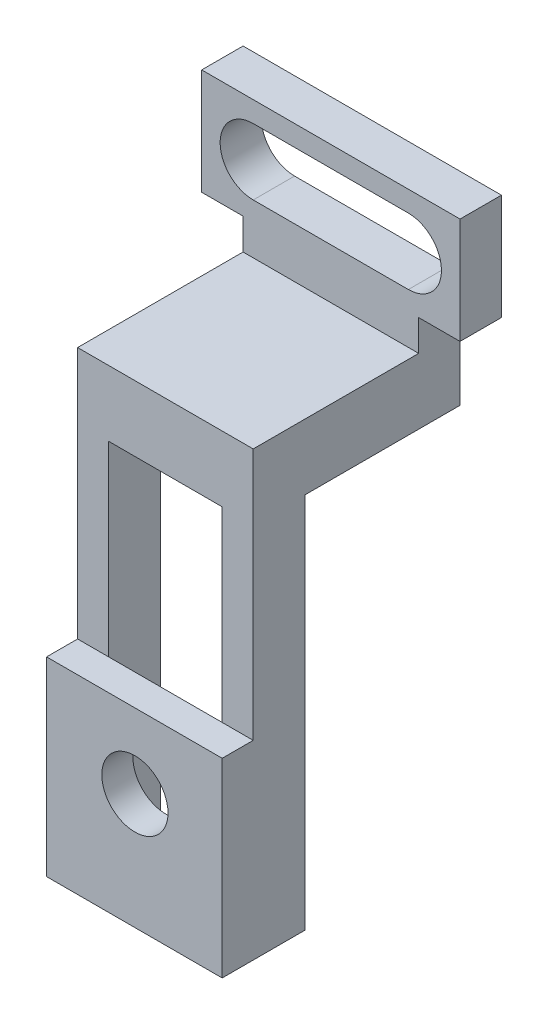
ISO-10303-21;
HEADER;
FILE_DESCRIPTION(('STEP AP214'),'2;1');
FILE_NAME('part.step','',(''),(''),'','','');
FILE_SCHEMA(('AUTOMOTIVE_DESIGN { 1 0 10303 214 1 1 1 1 }'));
ENDSEC;
DATA;
#1=APPLICATION_CONTEXT('core data for automotive mechanical design processes');
#2=APPLICATION_PROTOCOL_DEFINITION('international standard','automotive_design',2000,#1);
#3=PRODUCT_CONTEXT('',#1,'mechanical');
#4=PRODUCT('Part','Part','',(#3));
#5=PRODUCT_RELATED_PRODUCT_CATEGORY('part','',(#4));
#6=PRODUCT_DEFINITION_FORMATION('','',#4);
#7=PRODUCT_DEFINITION_CONTEXT('part definition',#1,'design');
#8=PRODUCT_DEFINITION('design','',#6,#7);
#9=PRODUCT_DEFINITION_SHAPE('','',#8);
#10=(LENGTH_UNIT() NAMED_UNIT(*) SI_UNIT(.MILLI.,.METRE.));
#11=(NAMED_UNIT(*) PLANE_ANGLE_UNIT() SI_UNIT($,.RADIAN.));
#12=(NAMED_UNIT(*) SI_UNIT($,.STERADIAN.) SOLID_ANGLE_UNIT());
#13=UNCERTAINTY_MEASURE_WITH_UNIT(LENGTH_MEASURE(1.E-05),#10,'distance_accuracy_value','');
#14=(GEOMETRIC_REPRESENTATION_CONTEXT(3) GLOBAL_UNCERTAINTY_ASSIGNED_CONTEXT((#13)) GLOBAL_UNIT_ASSIGNED_CONTEXT((#10,
#11,#12)) REPRESENTATION_CONTEXT('',''));
#15=CARTESIAN_POINT('',(0.,0.,0.));
#16=DIRECTION('',(0.,0.,1.));
#17=DIRECTION('',(1.,0.,0.));
#18=AXIS2_PLACEMENT_3D('',#15,#16,#17);
#19=CARTESIAN_POINT('',(0.,0.,-5.));
#20=DIRECTION('',(0.,0.,-1.));
#21=DIRECTION('',(-1.,0.,0.));
#22=AXIS2_PLACEMENT_3D('',#19,#20,#21);
#23=PLANE('',#22);
#24=DIRECTION('',(-1.,0.,0.));
#25=VECTOR('',#24,1.);
#26=CARTESIAN_POINT('',(9.31617884472005,27.3452534562212,-5.));
#27=LINE('',#26,#25);
#28=CARTESIAN_POINT('',(9.31617884472005,27.3452534562212,-5.));
#29=VERTEX_POINT('',#28);
#30=CARTESIAN_POINT('',(6.31617884472005,27.3452534562212,-5.));
#31=VERTEX_POINT('',#30);
#32=EDGE_CURVE('E317',#29,#31,#27,.T.);
#33=ORIENTED_EDGE('',*,*,#32,.F.);
#34=DIRECTION('',(0.,-1.,0.));
#35=VECTOR('',#34,1.);
#36=CARTESIAN_POINT('',(9.31617884472005,7.3452534562212,-5.));
#37=LINE('',#36,#35);
#38=CARTESIAN_POINT('',(9.31617884472005,-9.1097465437788,-5.));
#39=VERTEX_POINT('',#38);
#40=EDGE_CURVE('E362',#29,#39,#37,.T.);
#41=ORIENTED_EDGE('',*,*,#40,.T.);
#42=DIRECTION('',(-1.,0.,0.));
#43=VECTOR('',#42,1.);
#44=CARTESIAN_POINT('',(9.31617884472005,-9.1097465437788,-5.));
#45=LINE('',#44,#43);
#46=CARTESIAN_POINT('',(6.31617884472005,-9.1097465437788,-5.));
#47=VERTEX_POINT('',#46);
#48=EDGE_CURVE('E364',#39,#47,#45,.T.);
#49=ORIENTED_EDGE('',*,*,#48,.T.);
#50=DIRECTION('',(0.,1.,0.));
#51=VECTOR('',#50,1.);
#52=CARTESIAN_POINT('',(6.31617884472005,7.3452534562212,-5.));
#53=LINE('',#52,#51);
#54=EDGE_CURVE('E367',#47,#31,#53,.T.);
#55=ORIENTED_EDGE('',*,*,#54,.T.);
#56=EDGE_LOOP('',(#33,#41,#49,#55));
#57=FACE_BOUND('',#56,.T.);
#58=ADVANCED_FACE('F46',(#57),#23,.T.);
#59=CARTESIAN_POINT('',(0.,0.,0.));
#60=DIRECTION('',(0.,0.,1.));
#61=DIRECTION('',(1.,0.,0.));
#62=AXIS2_PLACEMENT_3D('',#59,#60,#61);
#63=PLANE('',#62);
#64=CARTESIAN_POINT('',(0.876178844720053,2.0902534562212,0.));
#65=DIRECTION('',(0.,0.,1.));
#66=DIRECTION('',(1.,0.,0.));
#67=AXIS2_PLACEMENT_3D('',#64,#65,#66);
#68=CIRCLE('',#67,3.2);
#69=CARTESIAN_POINT('',(4.07617884472005,2.0902534562212,0.));
#70=VERTEX_POINT('',#69);
#71=EDGE_CURVE('E387',#70,#70,#68,.T.);
#72=ORIENTED_EDGE('',*,*,#71,.T.);
#73=EDGE_LOOP('',(#72));
#74=FACE_BOUND('',#73,.T.);
#75=CARTESIAN_POINT('',(0.876178844720052,-6.0797465437788,0.));
#76=DIRECTION('',(0.,0.,1.));
#77=DIRECTION('',(1.,0.,0.));
#78=AXIS2_PLACEMENT_3D('',#75,#76,#77);
#79=CIRCLE('',#78,1.65);
#80=CARTESIAN_POINT('',(2.52617884472005,-6.0797465437788,0.));
#81=VERTEX_POINT('',#80);
#82=EDGE_CURVE('E393',#81,#81,#79,.F.);
#83=ORIENTED_EDGE('',*,*,#82,.F.);
#84=EDGE_LOOP('',(#83));
#85=FACE_BOUND('',#84,.T.);
#86=DIRECTION('',(1.,0.,0.));
#87=VECTOR('',#86,1.);
#88=CARTESIAN_POINT('',(-6.52382115527995,-9.1097465437788,0.));
#89=LINE('',#88,#87);
#90=CARTESIAN_POINT('',(-4.66382115527995,-9.1097465437788,0.));
#91=VERTEX_POINT('',#90);
#92=CARTESIAN_POINT('',(6.31617884472005,-9.1097465437788,0.));
#93=VERTEX_POINT('',#92);
#94=EDGE_CURVE('E385',#91,#93,#89,.T.);
#95=ORIENTED_EDGE('',*,*,#94,.F.);
#96=DIRECTION('',(0.,1.,0.));
#97=VECTOR('',#96,1.);
#98=CARTESIAN_POINT('',(-4.66382115527995,0.,0.));
#99=LINE('',#98,#97);
#100=CARTESIAN_POINT('',(-4.66382115527994,9.2902534562212,0.));
#101=VERTEX_POINT('',#100);
#102=EDGE_CURVE('E353',#91,#101,#99,.T.);
#103=ORIENTED_EDGE('',*,*,#102,.T.);
#104=DIRECTION('',(-1.,0.,0.));
#105=VECTOR('',#104,1.);
#106=CARTESIAN_POINT('',(6.31617884472005,9.2902534562212,0.));
#107=LINE('',#106,#105);
#108=CARTESIAN_POINT('',(6.31617884472005,9.2902534562212,0.));
#109=VERTEX_POINT('',#108);
#110=EDGE_CURVE('E356',#109,#101,#107,.T.);
#111=ORIENTED_EDGE('',*,*,#110,.F.);
#112=DIRECTION('',(0.,1.,0.));
#113=VECTOR('',#112,1.);
#114=CARTESIAN_POINT('',(6.31617884472005,7.3452534562212,0.));
#115=LINE('',#114,#113);
#116=EDGE_CURVE('E375',#93,#109,#115,.T.);
#117=ORIENTED_EDGE('',*,*,#116,.F.);
#118=EDGE_LOOP('',(#95,#103,#111,#117));
#119=FACE_BOUND('',#118,.T.);
#120=ADVANCED_FACE('F48',(#74,#85,#119),#63,.F.);
#121=CARTESIAN_POINT('',(0.,0.,3.));
#122=DIRECTION('',(0.,0.,1.));
#123=DIRECTION('',(1.,0.,0.));
#124=AXIS2_PLACEMENT_3D('',#121,#122,#123);
#125=PLANE('',#124);
#126=DIRECTION('',(1.,0.,0.));
#127=VECTOR('',#126,1.);
#128=CARTESIAN_POINT('',(0.,9.2902534562212,3.));
#129=LINE('',#128,#127);
#130=CARTESIAN_POINT('',(-7.66382115527995,9.2902534562212,3.));
#131=VERTEX_POINT('',#130);
#132=CARTESIAN_POINT('',(9.31617884472005,9.2902534562212,3.));
#133=VERTEX_POINT('',#132);
#134=EDGE_CURVE('E397',#131,#133,#129,.T.);
#135=ORIENTED_EDGE('',*,*,#134,.F.);
#136=DIRECTION('',(0.,1.,0.));
#137=VECTOR('',#136,1.);
#138=CARTESIAN_POINT('',(-7.66382115527995,-9.1097465437788,3.));
#139=LINE('',#138,#137);
#140=CARTESIAN_POINT('',(-7.66382115527995,-9.1097465437788,3.));
#141=VERTEX_POINT('',#140);
#142=EDGE_CURVE('E336',#141,#131,#139,.T.);
#143=ORIENTED_EDGE('',*,*,#142,.F.);
#144=DIRECTION('',(1.,0.,0.));
#145=VECTOR('',#144,1.);
#146=CARTESIAN_POINT('',(-6.52382115527995,-9.1097465437788,3.));
#147=LINE('',#146,#145);
#148=CARTESIAN_POINT('',(9.31617884472005,-9.1097465437788,3.));
#149=VERTEX_POINT('',#148);
#150=EDGE_CURVE('E384',#141,#149,#147,.T.);
#151=ORIENTED_EDGE('',*,*,#150,.T.);
#152=DIRECTION('',(0.,-1.,0.));
#153=VECTOR('',#152,1.);
#154=CARTESIAN_POINT('',(9.31617884472005,7.3452534562212,3.));
#155=LINE('',#154,#153);
#156=EDGE_CURVE('E370',#133,#149,#155,.T.);
#157=ORIENTED_EDGE('',*,*,#156,.F.);
#158=EDGE_LOOP('',(#135,#143,#151,#157));
#159=FACE_BOUND('',#158,.T.);
#160=CARTESIAN_POINT('',(0.876178844720053,2.0902534562212,3.));
#161=DIRECTION('',(0.,0.,1.));
#162=DIRECTION('',(1.,0.,0.));
#163=AXIS2_PLACEMENT_3D('',#160,#161,#162);
#164=CIRCLE('',#163,3.2);
#165=CARTESIAN_POINT('',(4.07617884472005,2.0902534562212,3.));
#166=VERTEX_POINT('',#165);
#167=EDGE_CURVE('E390',#166,#166,#164,.T.);
#168=ORIENTED_EDGE('',*,*,#167,.F.);
#169=EDGE_LOOP('',(#168));
#170=FACE_BOUND('',#169,.T.);
#171=ADVANCED_FACE('F442',(#159,#170),#125,.T.);
#172=CARTESIAN_POINT('',(0.876178844720053,2.0902534562212,3.));
#173=DIRECTION('',(0.,0.,-1.));
#174=DIRECTION('',(-1.,0.,0.));
#175=AXIS2_PLACEMENT_3D('',#172,#173,#174);
#176=CYLINDRICAL_SURFACE('',#175,3.2);
#177=ORIENTED_EDGE('',*,*,#167,.T.);
#178=EDGE_LOOP('',(#177));
#179=FACE_BOUND('',#178,.T.);
#180=ORIENTED_EDGE('',*,*,#71,.F.);
#181=EDGE_LOOP('',(#180));
#182=FACE_BOUND('',#181,.T.);
#183=ADVANCED_FACE('F481',(#179,#182),#176,.F.);
#184=CARTESIAN_POINT('',(-6.52382115527995,-9.1097465437788,0.));
#185=DIRECTION('',(0.,-1.,0.));
#186=DIRECTION('',(0.,0.,-1.));
#187=AXIS2_PLACEMENT_3D('',#184,#185,#186);
#188=PLANE('',#187);
#189=ORIENTED_EDGE('',*,*,#150,.F.);
#190=DIRECTION('',(0.,0.,1.));
#191=VECTOR('',#190,1.);
#192=CARTESIAN_POINT('',(-7.66382115527995,-9.1097465437788,3.));
#193=LINE('',#192,#191);
#194=CARTESIAN_POINT('',(-7.66382115527995,-9.1097465437788,-5.));
#195=VERTEX_POINT('',#194);
#196=EDGE_CURVE('E342',#195,#141,#193,.T.);
#197=ORIENTED_EDGE('',*,*,#196,.F.);
#198=DIRECTION('',(1.,0.,0.));
#199=VECTOR('',#198,1.);
#200=CARTESIAN_POINT('',(-7.66382115527995,-9.1097465437788,-5.));
#201=LINE('',#200,#199);
#202=CARTESIAN_POINT('',(-4.66382115527995,-9.1097465437788,-5.));
#203=VERTEX_POINT('',#202);
#204=EDGE_CURVE('E345',#195,#203,#201,.T.);
#205=ORIENTED_EDGE('',*,*,#204,.T.);
#206=DIRECTION('',(0.,0.,1.));
#207=VECTOR('',#206,1.);
#208=CARTESIAN_POINT('',(-4.66382115527995,-9.1097465437788,3.));
#209=LINE('',#208,#207);
#210=EDGE_CURVE('E340',#203,#91,#209,.T.);
#211=ORIENTED_EDGE('',*,*,#210,.T.);
#212=ORIENTED_EDGE('',*,*,#94,.T.);
#213=DIRECTION('',(0.,0.,1.));
#214=VECTOR('',#213,1.);
#215=CARTESIAN_POINT('',(6.31617884472005,-9.1097465437788,-3.));
#216=LINE('',#215,#214);
#217=EDGE_CURVE('E378',#47,#93,#216,.T.);
#218=ORIENTED_EDGE('',*,*,#217,.F.);
#219=ORIENTED_EDGE('',*,*,#48,.F.);
#220=DIRECTION('',(0.,0.,-1.));
#221=VECTOR('',#220,1.);
#222=CARTESIAN_POINT('',(9.31617884472005,-9.1097465437788,3.));
#223=LINE('',#222,#221);
#224=EDGE_CURVE('E372',#149,#39,#223,.T.);
#225=ORIENTED_EDGE('',*,*,#224,.F.);
#226=EDGE_LOOP('',(#189,#197,#205,#211,#212,#218,#219,#225));
#227=FACE_BOUND('',#226,.T.);
#228=ADVANCED_FACE('F449',(#227),#188,.T.);
#229=CARTESIAN_POINT('',(0.876178844720052,-6.0797465437788,-3.));
#230=DIRECTION('',(0.,0.,1.));
#231=DIRECTION('',(1.,0.,0.));
#232=AXIS2_PLACEMENT_3D('',#229,#230,#231);
#233=CYLINDRICAL_SURFACE('',#232,1.65);
#234=CARTESIAN_POINT('',(0.876178844720052,-6.0797465437788,-3.));
#235=DIRECTION('',(0.,0.,-1.));
#236=DIRECTION('',(-1.,0.,0.));
#237=AXIS2_PLACEMENT_3D('',#234,#235,#236);
#238=CIRCLE('',#237,1.65);
#239=CARTESIAN_POINT('',(-0.773821155279948,-6.0797465437788,-3.));
#240=VERTEX_POINT('',#239);
#241=EDGE_CURVE('E381',#240,#240,#238,.T.);
#242=ORIENTED_EDGE('',*,*,#241,.F.);
#243=EDGE_LOOP('',(#242));
#244=FACE_BOUND('',#243,.T.);
#245=ORIENTED_EDGE('',*,*,#82,.T.);
#246=EDGE_LOOP('',(#245));
#247=FACE_BOUND('',#246,.T.);
#248=ADVANCED_FACE('F486',(#244,#247),#233,.T.);
#249=CARTESIAN_POINT('',(0.876178844720052,-6.0797465437788,-3.));
#250=DIRECTION('',(0.,0.,-1.));
#251=DIRECTION('',(-1.,0.,0.));
#252=AXIS2_PLACEMENT_3D('',#249,#250,#251);
#253=PLANE('',#252);
#254=ORIENTED_EDGE('',*,*,#241,.T.);
#255=EDGE_LOOP('',(#254));
#256=FACE_BOUND('',#255,.T.);
#257=ADVANCED_FACE('F488',(#256),#253,.T.);
#258=CARTESIAN_POINT('',(6.31617884472005,7.3452534562212,-3.));
#259=DIRECTION('',(1.,0.,0.));
#260=DIRECTION('',(0.,1.,0.));
#261=AXIS2_PLACEMENT_3D('',#258,#259,#260);
#262=PLANE('',#261);
#263=ORIENTED_EDGE('',*,*,#116,.T.);
#264=DIRECTION('',(0.,1.,0.));
#265=VECTOR('',#264,1.);
#266=CARTESIAN_POINT('',(6.31617884472005,7.3452534562212,0.));
#267=LINE('',#266,#265);
#268=CARTESIAN_POINT('',(6.31617884472005,27.3452534562212,0.));
#269=VERTEX_POINT('',#268);
#270=EDGE_CURVE('E306',#109,#269,#267,.T.);
#271=ORIENTED_EDGE('',*,*,#270,.T.);
#272=DIRECTION('',(0.,0.,1.));
#273=VECTOR('',#272,1.);
#274=CARTESIAN_POINT('',(6.31617884472005,27.3452534562212,-5.));
#275=LINE('',#274,#273);
#276=EDGE_CURVE('E359',#31,#269,#275,.T.);
#277=ORIENTED_EDGE('',*,*,#276,.F.);
#278=ORIENTED_EDGE('',*,*,#54,.F.);
#279=ORIENTED_EDGE('',*,*,#217,.T.);
#280=EDGE_LOOP('',(#263,#271,#277,#278,#279));
#281=FACE_BOUND('',#280,.T.);
#282=ADVANCED_FACE('F454',(#281),#262,.F.);
#283=CARTESIAN_POINT('',(9.31617884472005,0.,0.));
#284=DIRECTION('',(1.,0.,0.));
#285=DIRECTION('',(0.,0.,-1.));
#286=AXIS2_PLACEMENT_3D('',#283,#284,#285);
#287=PLANE('',#286);
#288=DIRECTION('',(0.,0.,-1.));
#289=VECTOR('',#288,1.);
#290=CARTESIAN_POINT('',(9.31617884472005,36.6952534562212,-16.));
#291=LINE('',#290,#289);
#292=CARTESIAN_POINT('',(9.31617884472005,36.6952534562212,-16.));
#293=VERTEX_POINT('',#292);
#294=CARTESIAN_POINT('',(9.31617884472005,36.6952534562212,-20.));
#295=VERTEX_POINT('',#294);
#296=EDGE_CURVE('E271',#293,#295,#291,.T.);
#297=ORIENTED_EDGE('',*,*,#296,.F.);
#298=DIRECTION('',(0.,-1.,0.));
#299=VECTOR('',#298,1.);
#300=CARTESIAN_POINT('',(9.31617884472005,45.8952534562212,-16.));
#301=LINE('',#300,#299);
#302=CARTESIAN_POINT('',(9.31617884472005,33.6952534562212,-16.));
#303=VERTEX_POINT('',#302);
#304=EDGE_CURVE('E287',#293,#303,#301,.T.);
#305=ORIENTED_EDGE('',*,*,#304,.T.);
#306=DIRECTION('',(0.,0.,-1.));
#307=VECTOR('',#306,1.);
#308=CARTESIAN_POINT('',(9.31617884472005,33.6952534562212,-16.));
#309=LINE('',#308,#307);
#310=CARTESIAN_POINT('',(9.31617884472005,33.6952534562212,0.));
#311=VERTEX_POINT('',#310);
#312=EDGE_CURVE('E314',#311,#303,#309,.T.);
#313=ORIENTED_EDGE('',*,*,#312,.F.);
#314=DIRECTION('',(0.,1.,0.));
#315=VECTOR('',#314,1.);
#316=CARTESIAN_POINT('',(9.31617884472005,0.,0.));
#317=LINE('',#316,#315);
#318=CARTESIAN_POINT('',(9.31617884472005,9.2902534562212,0.));
#319=VERTEX_POINT('',#318);
#320=EDGE_CURVE('E309',#319,#311,#317,.T.);
#321=ORIENTED_EDGE('',*,*,#320,.F.);
#322=DIRECTION('',(0.,0.,-1.));
#323=VECTOR('',#322,1.);
#324=CARTESIAN_POINT('',(9.31617884472005,9.2902534562212,0.));
#325=LINE('',#324,#323);
#326=EDGE_CURVE('E312',#133,#319,#325,.T.);
#327=ORIENTED_EDGE('',*,*,#326,.F.);
#328=ORIENTED_EDGE('',*,*,#156,.T.);
#329=ORIENTED_EDGE('',*,*,#224,.T.);
#330=ORIENTED_EDGE('',*,*,#40,.F.);
#331=DIRECTION('',(0.,0.,1.));
#332=VECTOR('',#331,1.);
#333=CARTESIAN_POINT('',(9.31617884472005,27.3452534562212,-20.));
#334=LINE('',#333,#332);
#335=CARTESIAN_POINT('',(9.31617884472005,27.3452534562212,-20.));
#336=VERTEX_POINT('',#335);
#337=EDGE_CURVE('E330',#336,#29,#334,.T.);
#338=ORIENTED_EDGE('',*,*,#337,.F.);
#339=DIRECTION('',(0.,-1.,0.));
#340=VECTOR('',#339,1.);
#341=CARTESIAN_POINT('',(9.31617884472005,27.3452534562212,-20.));
#342=LINE('',#341,#340);
#343=EDGE_CURVE('E318',#295,#336,#342,.T.);
#344=ORIENTED_EDGE('',*,*,#343,.F.);
#345=EDGE_LOOP('',(#297,#305,#313,#321,#327,#328,#329,#330,#338,#344));
#346=FACE_BOUND('',#345,.T.);
#347=ADVANCED_FACE('F426',(#346),#287,.T.);
#348=CARTESIAN_POINT('',(-4.66382115527994,27.3452534562212,-5.));
#349=VERTEX_POINT('',#348);
#350=CARTESIAN_POINT('',(-7.66382115527994,27.3452534562212,-5.));
#351=VERTEX_POINT('',#350);
#352=EDGE_CURVE('E54',#349,#351,#27,.T.);
#353=ORIENTED_EDGE('',*,*,#352,.F.);
#354=DIRECTION('',(0.,-1.,0.));
#355=VECTOR('',#354,1.);
#356=CARTESIAN_POINT('',(-4.66382115527995,-9.1097465437788,-5.));
#357=LINE('',#356,#355);
#358=EDGE_CURVE('E347',#349,#203,#357,.T.);
#359=ORIENTED_EDGE('',*,*,#358,.T.);
#360=ORIENTED_EDGE('',*,*,#204,.F.);
#361=DIRECTION('',(0.,-1.,0.));
#362=VECTOR('',#361,1.);
#363=CARTESIAN_POINT('',(-7.66382115527995,-9.1097465437788,-5.));
#364=LINE('',#363,#362);
#365=EDGE_CURVE('E339',#351,#195,#364,.T.);
#366=ORIENTED_EDGE('',*,*,#365,.F.);
#367=EDGE_LOOP('',(#353,#359,#360,#366));
#368=FACE_BOUND('',#367,.T.);
#369=ADVANCED_FACE('F463',(#368),#23,.T.);
#370=CARTESIAN_POINT('',(6.31617884472005,9.2902534562212,20.));
#371=DIRECTION('',(0.,-1.,0.));
#372=DIRECTION('',(0.,0.,-1.));
#373=AXIS2_PLACEMENT_3D('',#370,#371,#372);
#374=PLANE('',#373);
#375=ORIENTED_EDGE('',*,*,#110,.T.);
#376=DIRECTION('',(-1.,0.,0.));
#377=VECTOR('',#376,1.);
#378=CARTESIAN_POINT('',(16.3361788447201,9.2902534562212,0.));
#379=LINE('',#378,#377);
#380=CARTESIAN_POINT('',(-7.66382115527995,9.2902534562212,0.));
#381=VERTEX_POINT('',#380);
#382=EDGE_CURVE('E297',#101,#381,#379,.T.);
#383=ORIENTED_EDGE('',*,*,#382,.T.);
#384=DIRECTION('',(0.,0.,1.));
#385=VECTOR('',#384,1.);
#386=CARTESIAN_POINT('',(-7.66382115527995,9.2902534562212,3.));
#387=LINE('',#386,#385);
#388=EDGE_CURVE('E294',#381,#131,#387,.T.);
#389=ORIENTED_EDGE('',*,*,#388,.T.);
#390=ORIENTED_EDGE('',*,*,#134,.T.);
#391=ORIENTED_EDGE('',*,*,#326,.T.);
#392=EDGE_CURVE('E299',#319,#109,#379,.T.);
#393=ORIENTED_EDGE('',*,*,#392,.T.);
#394=EDGE_LOOP('',(#375,#383,#389,#390,#391,#393));
#395=FACE_BOUND('',#394,.T.);
#396=ADVANCED_FACE('F457',(#395),#374,.F.);
#397=CARTESIAN_POINT('',(-7.66382115527995,0.,0.));
#398=DIRECTION('',(-1.,0.,0.));
#399=DIRECTION('',(0.,-1.,0.));
#400=AXIS2_PLACEMENT_3D('',#397,#398,#399);
#401=PLANE('',#400);
#402=DIRECTION('',(0.,0.,1.));
#403=VECTOR('',#402,1.);
#404=CARTESIAN_POINT('',(-7.66382115527994,36.6952534562212,-20.));
#405=LINE('',#404,#403);
#406=CARTESIAN_POINT('',(-7.66382115527994,36.6952534562212,-20.));
#407=VERTEX_POINT('',#406);
#408=CARTESIAN_POINT('',(-7.66382115527994,36.6952534562212,-16.));
#409=VERTEX_POINT('',#408);
#410=EDGE_CURVE('E256',#407,#409,#405,.T.);
#411=ORIENTED_EDGE('',*,*,#410,.F.);
#412=DIRECTION('',(0.,1.,0.));
#413=VECTOR('',#412,1.);
#414=CARTESIAN_POINT('',(-7.66382115527994,27.3452534562212,-20.));
#415=LINE('',#414,#413);
#416=CARTESIAN_POINT('',(-7.66382115527994,27.3452534562212,-20.));
#417=VERTEX_POINT('',#416);
#418=EDGE_CURVE('E322',#417,#407,#415,.T.);
#419=ORIENTED_EDGE('',*,*,#418,.F.);
#420=DIRECTION('',(0.,0.,1.));
#421=VECTOR('',#420,1.);
#422=CARTESIAN_POINT('',(-7.66382115527994,27.3452534562212,-20.));
#423=LINE('',#422,#421);
#424=EDGE_CURVE('E325',#417,#351,#423,.T.);
#425=ORIENTED_EDGE('',*,*,#424,.T.);
#426=ORIENTED_EDGE('',*,*,#365,.T.);
#427=ORIENTED_EDGE('',*,*,#196,.T.);
#428=ORIENTED_EDGE('',*,*,#142,.T.);
#429=ORIENTED_EDGE('',*,*,#388,.F.);
#430=DIRECTION('',(0.,-1.,0.));
#431=VECTOR('',#430,1.);
#432=CARTESIAN_POINT('',(-7.66382115527995,9.2902534562212,0.));
#433=LINE('',#432,#431);
#434=CARTESIAN_POINT('',(-7.66382115527994,33.6952534562212,0.));
#435=VERTEX_POINT('',#434);
#436=EDGE_CURVE('E291',#435,#381,#433,.T.);
#437=ORIENTED_EDGE('',*,*,#436,.F.);
#438=DIRECTION('',(0.,0.,1.));
#439=VECTOR('',#438,1.);
#440=CARTESIAN_POINT('',(-7.66382115527994,33.6952534562212,-5.));
#441=LINE('',#440,#439);
#442=CARTESIAN_POINT('',(-7.66382115527994,33.6952534562212,-16.));
#443=VERTEX_POINT('',#442);
#444=EDGE_CURVE('E333',#443,#435,#441,.T.);
#445=ORIENTED_EDGE('',*,*,#444,.F.);
#446=DIRECTION('',(0.,-1.,0.));
#447=VECTOR('',#446,1.);
#448=CARTESIAN_POINT('',(-7.66382115527994,45.8952534562212,-16.));
#449=LINE('',#448,#447);
#450=EDGE_CURVE('E289',#409,#443,#449,.T.);
#451=ORIENTED_EDGE('',*,*,#450,.F.);
#452=EDGE_LOOP('',(#411,#419,#425,#426,#427,#428,#429,#437,#445,#451));
#453=FACE_BOUND('',#452,.T.);
#454=ADVANCED_FACE('F411',(#453),#401,.T.);
#455=CARTESIAN_POINT('',(-4.66382115527995,0.,0.));
#456=DIRECTION('',(-1.,0.,0.));
#457=DIRECTION('',(0.,-1.,0.));
#458=AXIS2_PLACEMENT_3D('',#455,#456,#457);
#459=PLANE('',#458);
#460=DIRECTION('',(0.,0.,-1.));
#461=VECTOR('',#460,1.);
#462=CARTESIAN_POINT('',(-4.66382115527994,27.3452534562212,3.));
#463=LINE('',#462,#461);
#464=CARTESIAN_POINT('',(-4.66382115527994,27.3452534562212,0.));
#465=VERTEX_POINT('',#464);
#466=EDGE_CURVE('E335',#465,#349,#463,.T.);
#467=ORIENTED_EDGE('',*,*,#466,.F.);
#468=DIRECTION('',(0.,-1.,0.));
#469=VECTOR('',#468,1.);
#470=CARTESIAN_POINT('',(-4.66382115527995,0.,0.));
#471=LINE('',#470,#469);
#472=EDGE_CURVE('E303',#465,#101,#471,.T.);
#473=ORIENTED_EDGE('',*,*,#472,.T.);
#474=ORIENTED_EDGE('',*,*,#102,.F.);
#475=ORIENTED_EDGE('',*,*,#210,.F.);
#476=ORIENTED_EDGE('',*,*,#358,.F.);
#477=EDGE_LOOP('',(#467,#473,#474,#475,#476));
#478=FACE_BOUND('',#477,.T.);
#479=ADVANCED_FACE('F462',(#478),#459,.F.);
#480=CARTESIAN_POINT('',(0.,27.3452534562212,0.));
#481=DIRECTION('',(0.,1.,0.));
#482=DIRECTION('',(0.,0.,1.));
#483=AXIS2_PLACEMENT_3D('',#480,#481,#482);
#484=PLANE('',#483);
#485=ORIENTED_EDGE('',*,*,#276,.T.);
#486=DIRECTION('',(-1.,0.,0.));
#487=VECTOR('',#486,1.);
#488=CARTESIAN_POINT('',(0.,27.3452534562212,0.));
#489=LINE('',#488,#487);
#490=EDGE_CURVE('E300',#269,#465,#489,.T.);
#491=ORIENTED_EDGE('',*,*,#490,.T.);
#492=ORIENTED_EDGE('',*,*,#466,.T.);
#493=ORIENTED_EDGE('',*,*,#352,.T.);
#494=ORIENTED_EDGE('',*,*,#424,.F.);
#495=DIRECTION('',(-1.,0.,0.));
#496=VECTOR('',#495,1.);
#497=CARTESIAN_POINT('',(9.31617884472005,27.3452534562212,-20.));
#498=LINE('',#497,#496);
#499=EDGE_CURVE('E320',#336,#417,#498,.T.);
#500=ORIENTED_EDGE('',*,*,#499,.F.);
#501=ORIENTED_EDGE('',*,*,#337,.T.);
#502=ORIENTED_EDGE('',*,*,#32,.T.);
#503=EDGE_LOOP('',(#485,#491,#492,#493,#494,#500,#501,#502));
#504=FACE_BOUND('',#503,.T.);
#505=ADVANCED_FACE('F404',(#504),#484,.F.);
#506=CARTESIAN_POINT('',(0.,33.6952534562212,0.));
#507=DIRECTION('',(0.,1.,0.));
#508=DIRECTION('',(0.,0.,1.));
#509=AXIS2_PLACEMENT_3D('',#506,#507,#508);
#510=PLANE('',#509);
#511=DIRECTION('',(1.,0.,0.));
#512=VECTOR('',#511,1.);
#513=CARTESIAN_POINT('',(-7.66382115527994,33.6952534562212,-16.));
#514=LINE('',#513,#512);
#515=EDGE_CURVE('E285',#443,#303,#514,.T.);
#516=ORIENTED_EDGE('',*,*,#515,.F.);
#517=ORIENTED_EDGE('',*,*,#444,.T.);
#518=DIRECTION('',(-1.,0.,0.));
#519=VECTOR('',#518,1.);
#520=CARTESIAN_POINT('',(0.,33.6952534562212,0.));
#521=LINE('',#520,#519);
#522=EDGE_CURVE('E11',#311,#435,#521,.T.);
#523=ORIENTED_EDGE('',*,*,#522,.F.);
#524=ORIENTED_EDGE('',*,*,#312,.T.);
#525=EDGE_LOOP('',(#516,#517,#523,#524));
#526=FACE_BOUND('',#525,.T.);
#527=ADVANCED_FACE('F431',(#526),#510,.T.);
#528=CARTESIAN_POINT('',(0.,0.,-20.));
#529=DIRECTION('',(0.,0.,1.));
#530=DIRECTION('',(1.,0.,0.));
#531=AXIS2_PLACEMENT_3D('',#528,#529,#530);
#532=PLANE('',#531);
#533=DIRECTION('',(-1.,0.,0.));
#534=VECTOR('',#533,1.);
#535=CARTESIAN_POINT('',(8.31617884472005,38.5436801127465,-20.));
#536=LINE('',#535,#534);
#537=CARTESIAN_POINT('',(8.31617884472005,38.5436801127465,-20.));
#538=VERTEX_POINT('',#537);
#539=CARTESIAN_POINT('',(-6.68382115527994,38.5436801127465,-20.));
#540=VERTEX_POINT('',#539);
#541=EDGE_CURVE('E246',#538,#540,#536,.T.);
#542=ORIENTED_EDGE('',*,*,#541,.F.);
#543=CARTESIAN_POINT('',(8.31617884472005,41.7436801127465,-20.));
#544=DIRECTION('',(0.,0.,-1.));
#545=DIRECTION('',(-1.,0.,0.));
#546=AXIS2_PLACEMENT_3D('',#543,#544,#545);
#547=CIRCLE('',#546,3.2);
#548=CARTESIAN_POINT('',(8.31617884472005,44.9436801127465,-20.));
#549=VERTEX_POINT('',#548);
#550=EDGE_CURVE('E61',#549,#538,#547,.T.);
#551=ORIENTED_EDGE('',*,*,#550,.F.);
#552=DIRECTION('',(1.,0.,0.));
#553=VECTOR('',#552,1.);
#554=CARTESIAN_POINT('',(8.31617884472005,44.9436801127465,-20.));
#555=LINE('',#554,#553);
#556=CARTESIAN_POINT('',(-6.68382115527994,44.9436801127465,-20.));
#557=VERTEX_POINT('',#556);
#558=EDGE_CURVE('E237',#557,#549,#555,.T.);
#559=ORIENTED_EDGE('',*,*,#558,.F.);
#560=CARTESIAN_POINT('',(-6.68382115527994,41.7436801127465,-20.));
#561=DIRECTION('',(0.,0.,-1.));
#562=DIRECTION('',(-1.,0.,0.));
#563=AXIS2_PLACEMENT_3D('',#560,#561,#562);
#564=CIRCLE('',#563,3.2);
#565=EDGE_CURVE('E249',#540,#557,#564,.T.);
#566=ORIENTED_EDGE('',*,*,#565,.F.);
#567=EDGE_LOOP('',(#542,#551,#559,#566));
#568=FACE_BOUND('',#567,.T.);
#569=ORIENTED_EDGE('',*,*,#418,.T.);
#570=DIRECTION('',(1.,0.,0.));
#571=VECTOR('',#570,1.);
#572=CARTESIAN_POINT('',(-11.6638211552799,36.6952534562212,-20.));
#573=LINE('',#572,#571);
#574=CARTESIAN_POINT('',(-11.6638211552799,36.6952534562212,-20.));
#575=VERTEX_POINT('',#574);
#576=EDGE_CURVE('E268',#575,#407,#573,.T.);
#577=ORIENTED_EDGE('',*,*,#576,.F.);
#578=DIRECTION('',(0.,-1.,0.));
#579=VECTOR('',#578,1.);
#580=CARTESIAN_POINT('',(-11.6638211552799,45.8952534562212,-20.));
#581=LINE('',#580,#579);
#582=CARTESIAN_POINT('',(-11.6638211552799,46.9452534562212,-20.));
#583=VERTEX_POINT('',#582);
#584=EDGE_CURVE('E262',#583,#575,#581,.T.);
#585=ORIENTED_EDGE('',*,*,#584,.F.);
#586=DIRECTION('',(-1.,0.,0.));
#587=VECTOR('',#586,1.);
#588=CARTESIAN_POINT('',(-11.6638211552799,46.9452534562212,-20.));
#589=LINE('',#588,#587);
#590=CARTESIAN_POINT('',(13.3161788447201,46.9452534562212,-20.));
#591=VERTEX_POINT('',#590);
#592=EDGE_CURVE('E228',#591,#583,#589,.T.);
#593=ORIENTED_EDGE('',*,*,#592,.F.);
#594=DIRECTION('',(0.,1.,0.));
#595=VECTOR('',#594,1.);
#596=CARTESIAN_POINT('',(13.3161788447201,36.6952534562212,-20.));
#597=LINE('',#596,#595);
#598=CARTESIAN_POINT('',(13.3161788447201,36.6952534562212,-20.));
#599=VERTEX_POINT('',#598);
#600=EDGE_CURVE('E275',#599,#591,#597,.T.);
#601=ORIENTED_EDGE('',*,*,#600,.F.);
#602=DIRECTION('',(-1.,0.,0.));
#603=VECTOR('',#602,1.);
#604=CARTESIAN_POINT('',(13.3161788447201,36.6952534562212,-20.));
#605=LINE('',#604,#603);
#606=EDGE_CURVE('E277',#599,#295,#605,.T.);
#607=ORIENTED_EDGE('',*,*,#606,.T.);
#608=ORIENTED_EDGE('',*,*,#343,.T.);
#609=ORIENTED_EDGE('',*,*,#499,.T.);
#610=EDGE_LOOP('',(#569,#577,#585,#593,#601,#607,#608,#609));
#611=FACE_BOUND('',#610,.T.);
#612=ADVANCED_FACE('F415',(#568,#611),#532,.F.);
#613=CARTESIAN_POINT('',(16.3361788447201,9.2902534562212,0.));
#614=DIRECTION('',(0.,0.,-1.));
#615=DIRECTION('',(-1.,0.,0.));
#616=AXIS2_PLACEMENT_3D('',#613,#614,#615);
#617=PLANE('',#616);
#618=ORIENTED_EDGE('',*,*,#320,.T.);
#619=ORIENTED_EDGE('',*,*,#522,.T.);
#620=ORIENTED_EDGE('',*,*,#436,.T.);
#621=ORIENTED_EDGE('',*,*,#382,.F.);
#622=ORIENTED_EDGE('',*,*,#472,.F.);
#623=ORIENTED_EDGE('',*,*,#490,.F.);
#624=ORIENTED_EDGE('',*,*,#270,.F.);
#625=ORIENTED_EDGE('',*,*,#392,.F.);
#626=EDGE_LOOP('',(#618,#619,#620,#621,#622,#623,#624,#625));
#627=FACE_BOUND('',#626,.T.);
#628=ADVANCED_FACE('F436',(#627),#617,.F.);
#629=CARTESIAN_POINT('',(-7.66382115527994,45.8952534562212,-16.));
#630=DIRECTION('',(0.,0.,-1.));
#631=DIRECTION('',(-1.,0.,0.));
#632=AXIS2_PLACEMENT_3D('',#629,#630,#631);
#633=PLANE('',#632);
#634=DIRECTION('',(1.,0.,0.));
#635=VECTOR('',#634,1.);
#636=CARTESIAN_POINT('',(8.31617884472005,44.9436801127465,-16.));
#637=LINE('',#636,#635);
#638=CARTESIAN_POINT('',(-6.68382115527994,44.9436801127465,-16.));
#639=VERTEX_POINT('',#638);
#640=CARTESIAN_POINT('',(8.31617884472005,44.9436801127465,-16.));
#641=VERTEX_POINT('',#640);
#642=EDGE_CURVE('E241',#639,#641,#637,.T.);
#643=ORIENTED_EDGE('',*,*,#642,.T.);
#644=CARTESIAN_POINT('',(8.31617884472005,41.7436801127465,-16.));
#645=DIRECTION('',(0.,0.,-1.));
#646=DIRECTION('',(-1.,0.,0.));
#647=AXIS2_PLACEMENT_3D('',#644,#645,#646);
#648=CIRCLE('',#647,3.2);
#649=CARTESIAN_POINT('',(8.31617884472005,38.5436801127465,-16.));
#650=VERTEX_POINT('',#649);
#651=EDGE_CURVE('E233',#641,#650,#648,.T.);
#652=ORIENTED_EDGE('',*,*,#651,.T.);
#653=DIRECTION('',(-1.,0.,0.));
#654=VECTOR('',#653,1.);
#655=CARTESIAN_POINT('',(8.31617884472005,38.5436801127465,-16.));
#656=LINE('',#655,#654);
#657=CARTESIAN_POINT('',(-6.68382115527994,38.5436801127465,-16.));
#658=VERTEX_POINT('',#657);
#659=EDGE_CURVE('E236',#650,#658,#656,.T.);
#660=ORIENTED_EDGE('',*,*,#659,.T.);
#661=CARTESIAN_POINT('',(-6.68382115527994,41.7436801127465,-16.));
#662=DIRECTION('',(0.,0.,-1.));
#663=DIRECTION('',(-1.,0.,0.));
#664=AXIS2_PLACEMENT_3D('',#661,#662,#663);
#665=CIRCLE('',#664,3.2);
#666=EDGE_CURVE('E69',#658,#639,#665,.T.);
#667=ORIENTED_EDGE('',*,*,#666,.T.);
#668=EDGE_LOOP('',(#643,#652,#660,#667));
#669=FACE_BOUND('',#668,.T.);
#670=ORIENTED_EDGE('',*,*,#515,.T.);
#671=ORIENTED_EDGE('',*,*,#304,.F.);
#672=DIRECTION('',(-1.,0.,0.));
#673=VECTOR('',#672,1.);
#674=CARTESIAN_POINT('',(13.3161788447201,36.6952534562212,-16.));
#675=LINE('',#674,#673);
#676=CARTESIAN_POINT('',(13.3161788447201,36.6952534562212,-16.));
#677=VERTEX_POINT('',#676);
#678=EDGE_CURVE('E282',#677,#293,#675,.T.);
#679=ORIENTED_EDGE('',*,*,#678,.F.);
#680=DIRECTION('',(0.,-1.,0.));
#681=VECTOR('',#680,1.);
#682=CARTESIAN_POINT('',(13.3161788447201,36.6952534562212,-16.));
#683=LINE('',#682,#681);
#684=CARTESIAN_POINT('',(13.3161788447201,46.9452534562212,-16.));
#685=VERTEX_POINT('',#684);
#686=EDGE_CURVE('E219',#685,#677,#683,.T.);
#687=ORIENTED_EDGE('',*,*,#686,.F.);
#688=DIRECTION('',(1.,0.,0.));
#689=VECTOR('',#688,1.);
#690=CARTESIAN_POINT('',(-11.6638211552799,46.9452534562212,-16.));
#691=LINE('',#690,#689);
#692=CARTESIAN_POINT('',(-11.6638211552799,46.9452534562212,-16.));
#693=VERTEX_POINT('',#692);
#694=EDGE_CURVE('E214',#693,#685,#691,.T.);
#695=ORIENTED_EDGE('',*,*,#694,.F.);
#696=DIRECTION('',(0.,1.,0.));
#697=VECTOR('',#696,1.);
#698=CARTESIAN_POINT('',(-11.6638211552799,45.8952534562212,-16.));
#699=LINE('',#698,#697);
#700=CARTESIAN_POINT('',(-11.6638211552799,36.6952534562212,-16.));
#701=VERTEX_POINT('',#700);
#702=EDGE_CURVE('E201',#701,#693,#699,.T.);
#703=ORIENTED_EDGE('',*,*,#702,.F.);
#704=DIRECTION('',(1.,0.,0.));
#705=VECTOR('',#704,1.);
#706=CARTESIAN_POINT('',(-11.6638211552799,36.6952534562212,-16.));
#707=LINE('',#706,#705);
#708=EDGE_CURVE('E211',#701,#409,#707,.T.);
#709=ORIENTED_EDGE('',*,*,#708,.T.);
#710=ORIENTED_EDGE('',*,*,#450,.T.);
#711=EDGE_LOOP('',(#670,#671,#679,#687,#695,#703,#709,#710));
#712=FACE_BOUND('',#711,.T.);
#713=ADVANCED_FACE('F216',(#669,#712),#633,.F.);
#714=CARTESIAN_POINT('',(13.3161788447201,36.6952534562212,-16.));
#715=DIRECTION('',(0.,1.,0.));
#716=DIRECTION('',(0.,0.,1.));
#717=AXIS2_PLACEMENT_3D('',#714,#715,#716);
#718=PLANE('',#717);
#719=ORIENTED_EDGE('',*,*,#296,.T.);
#720=ORIENTED_EDGE('',*,*,#606,.F.);
#721=DIRECTION('',(0.,0.,-1.));
#722=VECTOR('',#721,1.);
#723=CARTESIAN_POINT('',(13.3161788447201,36.6952534562212,-16.));
#724=LINE('',#723,#722);
#725=EDGE_CURVE('E273',#677,#599,#724,.T.);
#726=ORIENTED_EDGE('',*,*,#725,.F.);
#727=ORIENTED_EDGE('',*,*,#678,.T.);
#728=EDGE_LOOP('',(#719,#720,#726,#727));
#729=FACE_BOUND('',#728,.T.);
#730=ADVANCED_FACE('F423',(#729),#718,.F.);
#731=CARTESIAN_POINT('',(13.3161788447201,0.,0.));
#732=DIRECTION('',(-1.,0.,0.));
#733=DIRECTION('',(0.,0.,1.));
#734=AXIS2_PLACEMENT_3D('',#731,#732,#733);
#735=PLANE('',#734);
#736=ORIENTED_EDGE('',*,*,#686,.T.);
#737=ORIENTED_EDGE('',*,*,#725,.T.);
#738=ORIENTED_EDGE('',*,*,#600,.T.);
#739=DIRECTION('',(0.,0.,-1.));
#740=VECTOR('',#739,1.);
#741=CARTESIAN_POINT('',(13.3161788447201,46.9452534562212,-20.));
#742=LINE('',#741,#740);
#743=EDGE_CURVE('E223',#685,#591,#742,.T.);
#744=ORIENTED_EDGE('',*,*,#743,.F.);
#745=EDGE_LOOP('',(#736,#737,#738,#744));
#746=FACE_BOUND('',#745,.T.);
#747=ADVANCED_FACE('F421',(#746),#735,.F.);
#748=CARTESIAN_POINT('',(-11.6638211552799,36.6952534562212,-20.));
#749=DIRECTION('',(0.,1.,0.));
#750=DIRECTION('',(-1.,0.,0.));
#751=AXIS2_PLACEMENT_3D('',#748,#749,#750);
#752=PLANE('',#751);
#753=ORIENTED_EDGE('',*,*,#410,.T.);
#754=ORIENTED_EDGE('',*,*,#708,.F.);
#755=DIRECTION('',(0.,0.,1.));
#756=VECTOR('',#755,1.);
#757=CARTESIAN_POINT('',(-11.6638211552799,36.6952534562212,-20.));
#758=LINE('',#757,#756);
#759=EDGE_CURVE('E207',#575,#701,#758,.T.);
#760=ORIENTED_EDGE('',*,*,#759,.F.);
#761=ORIENTED_EDGE('',*,*,#576,.T.);
#762=EDGE_LOOP('',(#753,#754,#760,#761));
#763=FACE_BOUND('',#762,.T.);
#764=ADVANCED_FACE('F417',(#763),#752,.F.);
#765=CARTESIAN_POINT('',(-11.6638211552799,0.,0.));
#766=DIRECTION('',(-1.,0.,0.));
#767=DIRECTION('',(0.,-1.,0.));
#768=AXIS2_PLACEMENT_3D('',#765,#766,#767);
#769=PLANE('',#768);
#770=ORIENTED_EDGE('',*,*,#584,.T.);
#771=ORIENTED_EDGE('',*,*,#759,.T.);
#772=ORIENTED_EDGE('',*,*,#702,.T.);
#773=DIRECTION('',(0.,0.,1.));
#774=VECTOR('',#773,1.);
#775=CARTESIAN_POINT('',(-11.6638211552799,46.9452534562212,-20.));
#776=LINE('',#775,#774);
#777=EDGE_CURVE('E206',#583,#693,#776,.T.);
#778=ORIENTED_EDGE('',*,*,#777,.F.);
#779=EDGE_LOOP('',(#770,#771,#772,#778));
#780=FACE_BOUND('',#779,.T.);
#781=ADVANCED_FACE('F204',(#780),#769,.T.);
#782=CARTESIAN_POINT('',(8.31617884472005,41.7436801127465,-16.));
#783=DIRECTION('',(0.,0.,-1.));
#784=DIRECTION('',(-1.,0.,0.));
#785=AXIS2_PLACEMENT_3D('',#782,#783,#784);
#786=CYLINDRICAL_SURFACE('',#785,3.2);
#787=ORIENTED_EDGE('',*,*,#550,.T.);
#788=DIRECTION('',(0.,0.,-1.));
#789=VECTOR('',#788,1.);
#790=CARTESIAN_POINT('',(8.31617884472005,38.5436801127465,-16.));
#791=LINE('',#790,#789);
#792=EDGE_CURVE('E244',#650,#538,#791,.T.);
#793=ORIENTED_EDGE('',*,*,#792,.F.);
#794=ORIENTED_EDGE('',*,*,#651,.F.);
#795=DIRECTION('',(0.,0.,-1.));
#796=VECTOR('',#795,1.);
#797=CARTESIAN_POINT('',(8.31617884472005,44.9436801127465,-16.));
#798=LINE('',#797,#796);
#799=EDGE_CURVE('E254',#641,#549,#798,.T.);
#800=ORIENTED_EDGE('',*,*,#799,.T.);
#801=EDGE_LOOP('',(#787,#793,#794,#800));
#802=FACE_BOUND('',#801,.T.);
#803=ADVANCED_FACE('F702',(#802),#786,.F.);
#804=CARTESIAN_POINT('',(8.31617884472005,44.9436801127465,-16.));
#805=DIRECTION('',(0.,1.,0.));
#806=DIRECTION('',(0.,0.,1.));
#807=AXIS2_PLACEMENT_3D('',#804,#805,#806);
#808=PLANE('',#807);
#809=ORIENTED_EDGE('',*,*,#558,.T.);
#810=ORIENTED_EDGE('',*,*,#799,.F.);
#811=ORIENTED_EDGE('',*,*,#642,.F.);
#812=DIRECTION('',(0.,0.,-1.));
#813=VECTOR('',#812,1.);
#814=CARTESIAN_POINT('',(-6.68382115527994,44.9436801127465,-16.));
#815=LINE('',#814,#813);
#816=EDGE_CURVE('E257',#639,#557,#815,.T.);
#817=ORIENTED_EDGE('',*,*,#816,.T.);
#818=EDGE_LOOP('',(#809,#810,#811,#817));
#819=FACE_BOUND('',#818,.T.);
#820=ADVANCED_FACE('F706',(#819),#808,.F.);
#821=CARTESIAN_POINT('',(-6.68382115527994,41.7436801127465,-16.));
#822=DIRECTION('',(0.,0.,-1.));
#823=DIRECTION('',(-1.,0.,0.));
#824=AXIS2_PLACEMENT_3D('',#821,#822,#823);
#825=CYLINDRICAL_SURFACE('',#824,3.2);
#826=ORIENTED_EDGE('',*,*,#565,.T.);
#827=ORIENTED_EDGE('',*,*,#816,.F.);
#828=ORIENTED_EDGE('',*,*,#666,.F.);
#829=DIRECTION('',(0.,0.,-1.));
#830=VECTOR('',#829,1.);
#831=CARTESIAN_POINT('',(-6.68382115527994,38.5436801127465,-16.));
#832=LINE('',#831,#830);
#833=EDGE_CURVE('E259',#658,#540,#832,.T.);
#834=ORIENTED_EDGE('',*,*,#833,.T.);
#835=EDGE_LOOP('',(#826,#827,#828,#834));
#836=FACE_BOUND('',#835,.T.);
#837=ADVANCED_FACE('F714',(#836),#825,.F.);
#838=CARTESIAN_POINT('',(8.31617884472005,38.5436801127465,-16.));
#839=DIRECTION('',(0.,-1.,0.));
#840=DIRECTION('',(0.,0.,-1.));
#841=AXIS2_PLACEMENT_3D('',#838,#839,#840);
#842=PLANE('',#841);
#843=ORIENTED_EDGE('',*,*,#541,.T.);
#844=ORIENTED_EDGE('',*,*,#833,.F.);
#845=ORIENTED_EDGE('',*,*,#659,.F.);
#846=ORIENTED_EDGE('',*,*,#792,.T.);
#847=EDGE_LOOP('',(#843,#844,#845,#846));
#848=FACE_BOUND('',#847,.T.);
#849=ADVANCED_FACE('F723',(#848),#842,.F.);
#850=CARTESIAN_POINT('',(0.,46.9452534562212,0.));
#851=DIRECTION('',(0.,1.,0.));
#852=DIRECTION('',(0.,0.,1.));
#853=AXIS2_PLACEMENT_3D('',#850,#851,#852);
#854=PLANE('',#853);
#855=ORIENTED_EDGE('',*,*,#777,.T.);
#856=ORIENTED_EDGE('',*,*,#694,.T.);
#857=ORIENTED_EDGE('',*,*,#743,.T.);
#858=ORIENTED_EDGE('',*,*,#592,.T.);
#859=EDGE_LOOP('',(#855,#856,#857,#858));
#860=FACE_BOUND('',#859,.T.);
#861=ADVANCED_FACE('F226',(#860),#854,.T.);
#862=CLOSED_SHELL('',(#58,#120,#171,#183,#228,#248,#257,#282,#347,#369,#396,#454,#479,#505,#527,
#612,#628,#713,#730,#747,#764,#781,#803,#820,#837,#849,#861));
#863=MANIFOLD_SOLID_BREP('B2',#862);
#864=ADVANCED_BREP_SHAPE_REPRESENTATION('',(#18,#863),#14);
#865=SHAPE_DEFINITION_REPRESENTATION(#9,#864);
ENDSEC;
END-ISO-10303-21;
